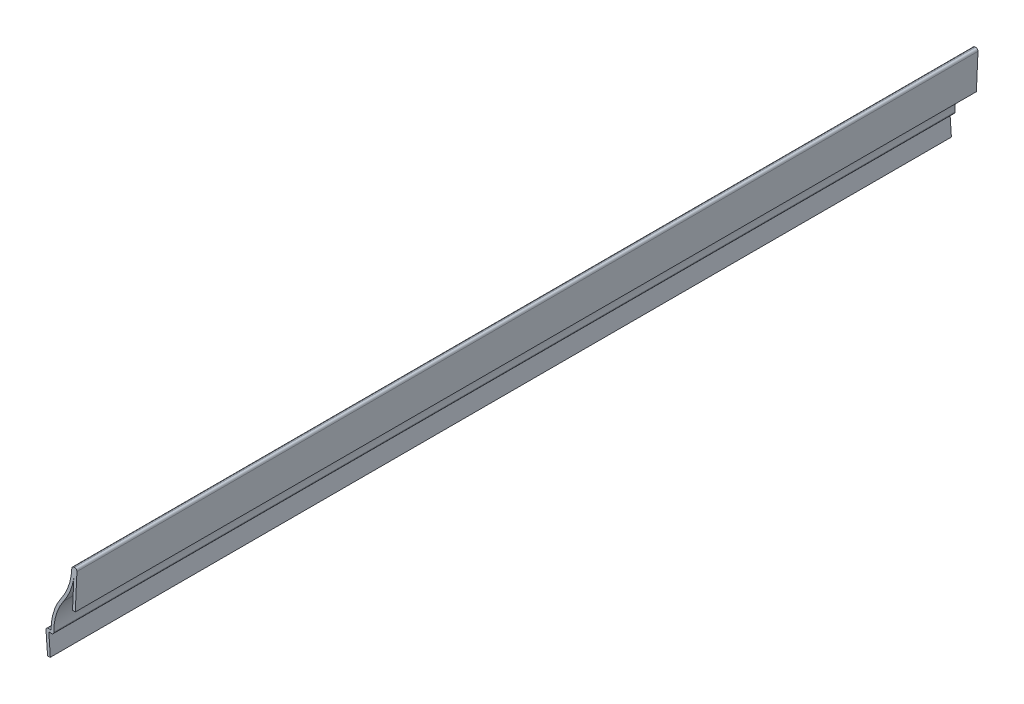
ISO-10303-21;
HEADER;
FILE_DESCRIPTION(('STEP AP214'),'2;1');
FILE_NAME('part.step','',(''),(''),'','','');
FILE_SCHEMA(('AUTOMOTIVE_DESIGN { 1 0 10303 214 1 1 1 1 }'));
ENDSEC;
DATA;
#1=APPLICATION_CONTEXT('core data for automotive mechanical design processes');
#2=APPLICATION_PROTOCOL_DEFINITION('international standard','automotive_design',2000,#1);
#3=PRODUCT_CONTEXT('',#1,'mechanical');
#4=PRODUCT('Part','Part','',(#3));
#5=PRODUCT_RELATED_PRODUCT_CATEGORY('part','',(#4));
#6=PRODUCT_DEFINITION_FORMATION('','',#4);
#7=PRODUCT_DEFINITION_CONTEXT('part definition',#1,'design');
#8=PRODUCT_DEFINITION('design','',#6,#7);
#9=PRODUCT_DEFINITION_SHAPE('','',#8);
#10=(LENGTH_UNIT() NAMED_UNIT(*) SI_UNIT(.MILLI.,.METRE.));
#11=(NAMED_UNIT(*) PLANE_ANGLE_UNIT() SI_UNIT($,.RADIAN.));
#12=(NAMED_UNIT(*) SI_UNIT($,.STERADIAN.) SOLID_ANGLE_UNIT());
#13=UNCERTAINTY_MEASURE_WITH_UNIT(LENGTH_MEASURE(1.E-05),#10,'distance_accuracy_value','');
#14=(GEOMETRIC_REPRESENTATION_CONTEXT(3) GLOBAL_UNCERTAINTY_ASSIGNED_CONTEXT((#13)) GLOBAL_UNIT_ASSIGNED_CONTEXT((#10,
#11,#12)) REPRESENTATION_CONTEXT('',''));
#15=CARTESIAN_POINT('',(0.,0.,0.));
#16=DIRECTION('',(0.,0.,1.));
#17=DIRECTION('',(1.,0.,0.));
#18=AXIS2_PLACEMENT_3D('',#15,#16,#17);
#19=CARTESIAN_POINT('',(12.2250599539329,41.3326677293667,-412.75));
#20=DIRECTION('',(-0.9989685402103,0.0454076609186498,0.));
#21=DIRECTION('',(-0.0454076609186498,-0.9989685402103,0.));
#22=AXIS2_PLACEMENT_3D('',#19,#20,#21);
#23=PLANE('',#22);
#24=DIRECTION('',(-0.0454076609186498,-0.9989685402103,0.));
#25=VECTOR('',#24,1.);
#26=CARTESIAN_POINT('',(12.2250599539329,41.3326677293667,0.));
#27=LINE('',#26,#25);
#28=CARTESIAN_POINT('',(12.0200511386789,36.8224737937788,0.));
#29=VERTEX_POINT('',#28);
#30=CARTESIAN_POINT('',(11.4313099539329,23.8701677293667,0.));
#31=VERTEX_POINT('',#30);
#32=EDGE_CURVE('E208',#29,#31,#27,.T.);
#33=ORIENTED_EDGE('',*,*,#32,.F.);
#34=DIRECTION('',(0.,0.,1.));
#35=VECTOR('',#34,1.);
#36=CARTESIAN_POINT('',(12.0200511386789,36.8224737937788,-412.75));
#37=LINE('',#36,#35);
#38=CARTESIAN_POINT('',(12.0200511386789,36.8224737937788,-412.75));
#39=VERTEX_POINT('',#38);
#40=EDGE_CURVE('E177',#39,#29,#37,.T.);
#41=ORIENTED_EDGE('',*,*,#40,.F.);
#42=DIRECTION('',(-0.0454076609186498,-0.9989685402103,0.));
#43=VECTOR('',#42,1.);
#44=CARTESIAN_POINT('',(12.2250599539329,41.3326677293667,-412.75));
#45=LINE('',#44,#43);
#46=CARTESIAN_POINT('',(11.4313099539329,23.8701677293667,-412.75));
#47=VERTEX_POINT('',#46);
#48=EDGE_CURVE('E159',#39,#47,#45,.T.);
#49=ORIENTED_EDGE('',*,*,#48,.T.);
#50=DIRECTION('',(0.,0.,1.));
#51=VECTOR('',#50,1.);
#52=CARTESIAN_POINT('',(11.4313099539329,23.8701677293667,-412.75));
#53=LINE('',#52,#51);
#54=EDGE_CURVE('E167',#47,#31,#53,.T.);
#55=ORIENTED_EDGE('',*,*,#54,.T.);
#56=EDGE_LOOP('',(#33,#41,#49,#55));
#57=FACE_BOUND('',#56,.T.);
#58=ADVANCED_FACE('F35',(#57),#23,.T.);
#59=CARTESIAN_POINT('',(-15.1473958333333,41.275,-412.75));
#60=DIRECTION('',(0.,0.,1.));
#61=DIRECTION('',(1.,0.,0.));
#62=AXIS2_PLACEMENT_3D('',#59,#60,#61);
#63=CYLINDRICAL_SURFACE('',#62,27.5298958333333);
#64=CARTESIAN_POINT('',(-15.1473958333333,41.275,0.));
#65=DIRECTION('',(0.,0.,1.));
#66=DIRECTION('',(1.,0.,0.));
#67=AXIS2_PLACEMENT_3D('',#64,#65,#66);
#68=CIRCLE('',#67,27.5298958333333);
#69=CARTESIAN_POINT('',(7.3896725440806,25.4643797229219,0.));
#70=VERTEX_POINT('',#69);
#71=EDGE_CURVE('E178',#70,#29,#68,.T.);
#72=ORIENTED_EDGE('',*,*,#71,.F.);
#73=DIRECTION('',(0.,0.,1.));
#74=VECTOR('',#73,1.);
#75=CARTESIAN_POINT('',(7.3896725440806,25.4643797229219,-412.75));
#76=LINE('',#75,#74);
#77=CARTESIAN_POINT('',(7.3896725440806,25.4643797229219,-412.75));
#78=VERTEX_POINT('',#77);
#79=EDGE_CURVE('E236',#78,#70,#76,.T.);
#80=ORIENTED_EDGE('',*,*,#79,.F.);
#81=CARTESIAN_POINT('',(-15.1473958333333,41.275,-412.75));
#82=DIRECTION('',(0.,0.,1.));
#83=DIRECTION('',(1.,0.,0.));
#84=AXIS2_PLACEMENT_3D('',#81,#82,#83);
#85=CIRCLE('',#84,27.5298958333333);
#86=EDGE_CURVE('E175',#78,#39,#85,.T.);
#87=ORIENTED_EDGE('',*,*,#86,.T.);
#88=ORIENTED_EDGE('',*,*,#40,.T.);
#89=EDGE_LOOP('',(#72,#80,#87,#88));
#90=FACE_BOUND('',#89,.T.);
#91=ADVANCED_FACE('F300',(#90),#63,.T.);
#92=CARTESIAN_POINT('',(27.8473958333333,11.1125,-412.75));
#93=DIRECTION('',(0.,0.,1.));
#94=DIRECTION('',(1.,0.,0.));
#95=AXIS2_PLACEMENT_3D('',#92,#93,#94);
#96=CYLINDRICAL_SURFACE('',#95,24.9898958333333);
#97=CARTESIAN_POINT('',(27.8473958333333,11.1125,0.));
#98=DIRECTION('',(0.,0.,1.));
#99=DIRECTION('',(1.,0.,0.));
#100=AXIS2_PLACEMENT_3D('',#97,#98,#99);
#101=CIRCLE('',#100,24.9898958333333);
#102=CARTESIAN_POINT('',(2.85869197899905,10.8684232882287,0.));
#103=VERTEX_POINT('',#102);
#104=EDGE_CURVE('E181',#103,#70,#101,.F.);
#105=ORIENTED_EDGE('',*,*,#104,.F.);
#106=DIRECTION('',(0.,0.,1.));
#107=VECTOR('',#106,1.);
#108=CARTESIAN_POINT('',(2.85869197899905,10.8684232882287,-412.75));
#109=LINE('',#108,#107);
#110=CARTESIAN_POINT('',(2.85869197899905,10.8684232882287,-412.75));
#111=VERTEX_POINT('',#110);
#112=EDGE_CURVE('E263',#103,#111,#109,.F.);
#113=ORIENTED_EDGE('',*,*,#112,.T.);
#114=CARTESIAN_POINT('',(27.8473958333333,11.1125,-412.75));
#115=DIRECTION('',(0.,0.,1.));
#116=DIRECTION('',(1.,0.,0.));
#117=AXIS2_PLACEMENT_3D('',#114,#115,#116);
#118=CIRCLE('',#117,24.9898958333333);
#119=EDGE_CURVE('E205',#111,#78,#118,.F.);
#120=ORIENTED_EDGE('',*,*,#119,.T.);
#121=ORIENTED_EDGE('',*,*,#79,.T.);
#122=EDGE_LOOP('',(#105,#113,#120,#121));
#123=FACE_BOUND('',#122,.T.);
#124=ADVANCED_FACE('F356',(#123),#96,.F.);
#125=CARTESIAN_POINT('',(-0.793750000000003,9.8425,-412.75));
#126=DIRECTION('',(0.,-1.,0.));
#127=DIRECTION('',(1.,0.,0.));
#128=AXIS2_PLACEMENT_3D('',#125,#126,#127);
#129=PLANE('',#128);
#130=DIRECTION('',(1.,0.,0.));
#131=VECTOR('',#130,1.);
#132=CARTESIAN_POINT('',(-0.793750000000003,9.8425,-412.75));
#133=LINE('',#132,#131);
#134=CARTESIAN_POINT('',(0.570199959748221,9.8425,-412.75));
#135=VERTEX_POINT('',#134);
#136=CARTESIAN_POINT('',(1.84274044061214,9.8425,-412.75));
#137=VERTEX_POINT('',#136);
#138=EDGE_CURVE('E202',#135,#137,#133,.T.);
#139=ORIENTED_EDGE('',*,*,#138,.T.);
#140=DIRECTION('',(0.,0.,1.));
#141=VECTOR('',#140,1.);
#142=CARTESIAN_POINT('',(1.84274044061214,9.8425,-412.75));
#143=LINE('',#142,#141);
#144=CARTESIAN_POINT('',(1.84274044061214,9.8425,0.));
#145=VERTEX_POINT('',#144);
#146=EDGE_CURVE('E235',#137,#145,#143,.T.);
#147=ORIENTED_EDGE('',*,*,#146,.T.);
#148=DIRECTION('',(1.,0.,0.));
#149=VECTOR('',#148,1.);
#150=CARTESIAN_POINT('',(-0.793750000000003,9.8425,0.));
#151=LINE('',#150,#149);
#152=CARTESIAN_POINT('',(0.570199959748221,9.8425,0.));
#153=VERTEX_POINT('',#152);
#154=EDGE_CURVE('E230',#153,#145,#151,.T.);
#155=ORIENTED_EDGE('',*,*,#154,.F.);
#156=DIRECTION('',(0.,0.,1.));
#157=VECTOR('',#156,1.);
#158=CARTESIAN_POINT('',(0.570199959748221,9.8425,-412.75));
#159=LINE('',#158,#157);
#160=EDGE_CURVE('E239',#135,#153,#159,.T.);
#161=ORIENTED_EDGE('',*,*,#160,.F.);
#162=EDGE_LOOP('',(#139,#147,#155,#161));
#163=FACE_BOUND('',#162,.T.);
#164=ADVANCED_FACE('F310',(#163),#129,.T.);
#165=CARTESIAN_POINT('',(1.26677254878503,0.0904837534846454,-412.75));
#166=DIRECTION('',(0.997458699830735,0.0712470499879098,0.));
#167=DIRECTION('',(-0.0712470499879098,0.997458699830735,0.));
#168=AXIS2_PLACEMENT_3D('',#165,#166,#167);
#169=PLANE('',#168);
#170=DIRECTION('',(-0.0712470499879098,0.997458699830735,0.));
#171=VECTOR('',#170,1.);
#172=CARTESIAN_POINT('',(1.26677254878503,0.0904837534846454,0.));
#173=LINE('',#172,#171);
#174=CARTESIAN_POINT('',(1.26677254878503,0.0904837534846454,0.));
#175=VERTEX_POINT('',#174);
#176=EDGE_CURVE('E227',#175,#153,#173,.T.);
#177=ORIENTED_EDGE('',*,*,#176,.F.);
#178=DIRECTION('',(0.,0.,1.));
#179=VECTOR('',#178,1.);
#180=CARTESIAN_POINT('',(1.26677254878503,0.0904837534846454,-412.75));
#181=LINE('',#180,#179);
#182=CARTESIAN_POINT('',(1.26677254878503,0.0904837534846454,-412.75));
#183=VERTEX_POINT('',#182);
#184=EDGE_CURVE('E241',#183,#175,#181,.T.);
#185=ORIENTED_EDGE('',*,*,#184,.F.);
#186=DIRECTION('',(-0.0712470499879098,0.997458699830735,0.));
#187=VECTOR('',#186,1.);
#188=CARTESIAN_POINT('',(1.26677254878503,0.0904837534846454,-412.75));
#189=LINE('',#188,#187);
#190=EDGE_CURVE('E199',#183,#135,#189,.T.);
#191=ORIENTED_EDGE('',*,*,#190,.T.);
#192=ORIENTED_EDGE('',*,*,#160,.T.);
#193=EDGE_LOOP('',(#177,#185,#191,#192));
#194=FACE_BOUND('',#193,.T.);
#195=ADVANCED_FACE('F315',(#194),#169,.T.);
#196=CARTESIAN_POINT('',(1.26677254878503,0.0904837534846454,-412.75));
#197=DIRECTION('',(-0.0712470499879098,0.997458699830735,0.));
#198=DIRECTION('',(-0.997458699830735,-0.0712470499879098,0.));
#199=AXIS2_PLACEMENT_3D('',#196,#197,#198);
#200=PLANE('',#199);
#201=DIRECTION('',(-0.997458699830735,-0.0712470499879098,0.));
#202=VECTOR('',#201,1.);
#203=CARTESIAN_POINT('',(1.26677254878503,0.0904837534846454,0.));
#204=LINE('',#203,#202);
#205=CARTESIAN_POINT('',(0.,0.,0.));
#206=VERTEX_POINT('',#205);
#207=EDGE_CURVE('E225',#175,#206,#204,.T.);
#208=ORIENTED_EDGE('',*,*,#207,.T.);
#209=DIRECTION('',(0.,0.,1.));
#210=VECTOR('',#209,1.);
#211=CARTESIAN_POINT('',(0.,0.,-412.75));
#212=LINE('',#211,#210);
#213=CARTESIAN_POINT('',(0.,0.,-412.75));
#214=VERTEX_POINT('',#213);
#215=EDGE_CURVE('E243',#214,#206,#212,.T.);
#216=ORIENTED_EDGE('',*,*,#215,.F.);
#217=DIRECTION('',(-0.997458699830735,-0.0712470499879098,0.));
#218=VECTOR('',#217,1.);
#219=CARTESIAN_POINT('',(1.26677254878503,0.0904837534846454,-412.75));
#220=LINE('',#219,#218);
#221=EDGE_CURVE('E197',#183,#214,#220,.T.);
#222=ORIENTED_EDGE('',*,*,#221,.F.);
#223=ORIENTED_EDGE('',*,*,#184,.T.);
#224=EDGE_LOOP('',(#208,#216,#222,#223));
#225=FACE_BOUND('',#224,.T.);
#226=ADVANCED_FACE('F322',(#225),#200,.F.);
#227=CARTESIAN_POINT('',(0.,0.,-412.75));
#228=DIRECTION('',(0.997458699830735,0.0712470499879098,0.));
#229=DIRECTION('',(-0.0712470499879098,0.997458699830735,0.));
#230=AXIS2_PLACEMENT_3D('',#227,#228,#229);
#231=PLANE('',#230);
#232=DIRECTION('',(-0.0712470499879098,0.997458699830735,0.));
#233=VECTOR('',#232,1.);
#234=CARTESIAN_POINT('',(0.,0.,0.));
#235=LINE('',#234,#233);
#236=CARTESIAN_POINT('',(-0.71600807122945,10.0241129972123,0.));
#237=VERTEX_POINT('',#236);
#238=EDGE_CURVE('E222',#206,#237,#235,.T.);
#239=ORIENTED_EDGE('',*,*,#238,.T.);
#240=DIRECTION('',(0.,0.,1.));
#241=VECTOR('',#240,1.);
#242=CARTESIAN_POINT('',(-0.71600807122945,10.0241129972123,-412.75));
#243=LINE('',#242,#241);
#244=CARTESIAN_POINT('',(-0.71600807122945,10.0241129972123,-412.75));
#245=VERTEX_POINT('',#244);
#246=EDGE_CURVE('E275',#237,#245,#243,.F.);
#247=ORIENTED_EDGE('',*,*,#246,.T.);
#248=DIRECTION('',(-0.0712470499879098,0.997458699830735,0.));
#249=VECTOR('',#248,1.);
#250=CARTESIAN_POINT('',(0.,0.,-412.75));
#251=LINE('',#250,#249);
#252=EDGE_CURVE('E194',#214,#245,#251,.T.);
#253=ORIENTED_EDGE('',*,*,#252,.F.);
#254=ORIENTED_EDGE('',*,*,#215,.T.);
#255=EDGE_LOOP('',(#239,#247,#253,#254));
#256=FACE_BOUND('',#255,.T.);
#257=ADVANCED_FACE('F324',(#256),#231,.F.);
#258=CARTESIAN_POINT('',(-0.793750000000001,11.1125,-412.75));
#259=DIRECTION('',(0.,-1.,0.));
#260=DIRECTION('',(1.,0.,0.));
#261=AXIS2_PLACEMENT_3D('',#258,#259,#260);
#262=PLANE('',#261);
#263=DIRECTION('',(1.,0.,0.));
#264=VECTOR('',#263,1.);
#265=CARTESIAN_POINT('',(-0.793750000000001,11.1125,-412.75));
#266=LINE('',#265,#264);
#267=CARTESIAN_POINT('',(0.297409967798578,11.1125,-412.75));
#268=VERTEX_POINT('',#267);
#269=CARTESIAN_POINT('',(1.58750000000001,11.1125,-412.75));
#270=VERTEX_POINT('',#269);
#271=EDGE_CURVE('E192',#268,#270,#266,.T.);
#272=ORIENTED_EDGE('',*,*,#271,.F.);
#273=DIRECTION('',(0.,0.,1.));
#274=VECTOR('',#273,1.);
#275=CARTESIAN_POINT('',(0.297409967798578,11.1125,-412.75));
#276=LINE('',#275,#274);
#277=CARTESIAN_POINT('',(0.297409967798578,11.1125,0.));
#278=VERTEX_POINT('',#277);
#279=EDGE_CURVE('E272',#268,#278,#276,.T.);
#280=ORIENTED_EDGE('',*,*,#279,.T.);
#281=DIRECTION('',(1.,0.,0.));
#282=VECTOR('',#281,1.);
#283=CARTESIAN_POINT('',(-0.793750000000001,11.1125,0.));
#284=LINE('',#283,#282);
#285=CARTESIAN_POINT('',(1.58750000000001,11.1125,0.));
#286=VERTEX_POINT('',#285);
#287=EDGE_CURVE('E220',#278,#286,#284,.T.);
#288=ORIENTED_EDGE('',*,*,#287,.T.);
#289=DIRECTION('',(0.,0.,1.));
#290=VECTOR('',#289,1.);
#291=CARTESIAN_POINT('',(1.58750000000001,11.1125,-412.75));
#292=LINE('',#291,#290);
#293=EDGE_CURVE('E246',#270,#286,#292,.T.);
#294=ORIENTED_EDGE('',*,*,#293,.F.);
#295=EDGE_LOOP('',(#272,#280,#288,#294));
#296=FACE_BOUND('',#295,.T.);
#297=ADVANCED_FACE('F332',(#296),#262,.F.);
#298=CARTESIAN_POINT('',(27.8473958333333,11.1125,-412.75));
#299=DIRECTION('',(0.,0.,1.));
#300=DIRECTION('',(1.,0.,0.));
#301=AXIS2_PLACEMENT_3D('',#298,#299,#300);
#302=CYLINDRICAL_SURFACE('',#301,26.2598958333333);
#303=CARTESIAN_POINT('',(27.8473958333333,11.1125,0.));
#304=DIRECTION('',(0.,0.,-1.));
#305=DIRECTION('',(-1.,0.,0.));
#306=AXIS2_PLACEMENT_3D('',#303,#304,#305);
#307=CIRCLE('',#306,26.2598958333333);
#308=CARTESIAN_POINT('',(6.35,26.19375,0.));
#309=VERTEX_POINT('',#308);
#310=EDGE_CURVE('E218',#286,#309,#307,.T.);
#311=ORIENTED_EDGE('',*,*,#310,.T.);
#312=DIRECTION('',(0.,0.,1.));
#313=VECTOR('',#312,1.);
#314=CARTESIAN_POINT('',(6.35,26.19375,-412.75));
#315=LINE('',#314,#313);
#316=CARTESIAN_POINT('',(6.35,26.19375,-412.75));
#317=VERTEX_POINT('',#316);
#318=EDGE_CURVE('E249',#317,#309,#315,.T.);
#319=ORIENTED_EDGE('',*,*,#318,.F.);
#320=CARTESIAN_POINT('',(27.8473958333333,11.1125,-412.75));
#321=DIRECTION('',(0.,0.,-1.));
#322=DIRECTION('',(-1.,0.,0.));
#323=AXIS2_PLACEMENT_3D('',#320,#321,#322);
#324=CIRCLE('',#323,26.2598958333333);
#325=EDGE_CURVE('E190',#270,#317,#324,.T.);
#326=ORIENTED_EDGE('',*,*,#325,.F.);
#327=ORIENTED_EDGE('',*,*,#293,.T.);
#328=EDGE_LOOP('',(#311,#319,#326,#327));
#329=FACE_BOUND('',#328,.T.);
#330=ADVANCED_FACE('F338',(#329),#302,.T.);
#331=CARTESIAN_POINT('',(-15.1473958333333,41.275,-412.75));
#332=DIRECTION('',(0.,0.,1.));
#333=DIRECTION('',(1.,0.,0.));
#334=AXIS2_PLACEMENT_3D('',#331,#332,#333);
#335=CYLINDRICAL_SURFACE('',#334,26.2598958333333);
#336=CARTESIAN_POINT('',(-15.1473958333333,41.275,0.));
#337=DIRECTION('',(0.,0.,1.));
#338=DIRECTION('',(1.,0.,0.));
#339=AXIS2_PLACEMENT_3D('',#336,#337,#338);
#340=CIRCLE('',#339,26.2598958333333);
#341=CARTESIAN_POINT('',(11.0942760256311,40.2968449898147,0.));
#342=VERTEX_POINT('',#341);
#343=EDGE_CURVE('E215',#309,#342,#340,.T.);
#344=ORIENTED_EDGE('',*,*,#343,.T.);
#345=DIRECTION('',(0.,0.,1.));
#346=VECTOR('',#345,1.);
#347=CARTESIAN_POINT('',(11.0942760256311,40.2968449898147,-412.75));
#348=LINE('',#347,#346);
#349=CARTESIAN_POINT('',(11.0942760256311,40.2968449898147,-412.75));
#350=VERTEX_POINT('',#349);
#351=EDGE_CURVE('E11',#342,#350,#348,.F.);
#352=ORIENTED_EDGE('',*,*,#351,.T.);
#353=CARTESIAN_POINT('',(-15.1473958333333,41.275,-412.75));
#354=DIRECTION('',(0.,0.,1.));
#355=DIRECTION('',(1.,0.,0.));
#356=AXIS2_PLACEMENT_3D('',#353,#354,#355);
#357=CIRCLE('',#356,26.2598958333333);
#358=EDGE_CURVE('E187',#317,#350,#357,.T.);
#359=ORIENTED_EDGE('',*,*,#358,.F.);
#360=ORIENTED_EDGE('',*,*,#318,.T.);
#361=EDGE_LOOP('',(#344,#352,#359,#360));
#362=FACE_BOUND('',#361,.T.);
#363=ADVANCED_FACE('F342',(#362),#335,.F.);
#364=CARTESIAN_POINT('',(11.1125,41.275,-412.75));
#365=DIRECTION('',(0.,-1.,0.));
#366=DIRECTION('',(1.,0.,0.));
#367=AXIS2_PLACEMENT_3D('',#364,#365,#366);
#368=PLANE('',#367);
#369=DIRECTION('',(1.,0.,0.));
#370=VECTOR('',#369,1.);
#371=CARTESIAN_POINT('',(11.1125,41.275,0.));
#372=LINE('',#371,#370);
#373=CARTESIAN_POINT('',(12.1095709368495,41.275,0.));
#374=VERTEX_POINT('',#373);
#375=CARTESIAN_POINT('',(12.4305191366239,41.275,0.));
#376=VERTEX_POINT('',#375);
#377=EDGE_CURVE('E213',#374,#376,#372,.T.);
#378=ORIENTED_EDGE('',*,*,#377,.T.);
#379=DIRECTION('',(0.,0.,1.));
#380=VECTOR('',#379,1.);
#381=CARTESIAN_POINT('',(12.4305191366239,41.275,-412.75));
#382=LINE('',#381,#380);
#383=CARTESIAN_POINT('',(12.4305191366239,41.275,-412.75));
#384=VERTEX_POINT('',#383);
#385=EDGE_CURVE('E43',#376,#384,#382,.F.);
#386=ORIENTED_EDGE('',*,*,#385,.T.);
#387=DIRECTION('',(1.,0.,0.));
#388=VECTOR('',#387,1.);
#389=CARTESIAN_POINT('',(11.1125,41.275,-412.75));
#390=LINE('',#389,#388);
#391=CARTESIAN_POINT('',(12.1095709368495,41.275,-412.75));
#392=VERTEX_POINT('',#391);
#393=EDGE_CURVE('E185',#392,#384,#390,.T.);
#394=ORIENTED_EDGE('',*,*,#393,.F.);
#395=DIRECTION('',(0.,0.,1.));
#396=VECTOR('',#395,1.);
#397=CARTESIAN_POINT('',(12.1095709368495,41.275,-412.75));
#398=LINE('',#397,#396);
#399=EDGE_CURVE('E280',#392,#374,#398,.T.);
#400=ORIENTED_EDGE('',*,*,#399,.T.);
#401=EDGE_LOOP('',(#378,#386,#394,#400));
#402=FACE_BOUND('',#401,.T.);
#403=ADVANCED_FACE('F284',(#402),#368,.F.);
#404=CARTESIAN_POINT('',(13.49375,41.275,-412.75));
#405=DIRECTION('',(-0.9989685402103,0.0454076609186498,0.));
#406=DIRECTION('',(-0.0454076609186498,-0.9989685402103,0.));
#407=AXIS2_PLACEMENT_3D('',#404,#405,#406);
#408=PLANE('',#407);
#409=DIRECTION('',(-0.0454076609186499,-0.9989685402103,0.));
#410=VECTOR('',#409,1.);
#411=CARTESIAN_POINT('',(13.49375,41.275,-412.75));
#412=LINE('',#411,#410);
#413=CARTESIAN_POINT('',(13.4454711734776,40.2128658165066,-412.75));
#414=VERTEX_POINT('',#413);
#415=CARTESIAN_POINT('',(12.7,23.8125,-412.75));
#416=VERTEX_POINT('',#415);
#417=EDGE_CURVE('E161',#414,#416,#412,.T.);
#418=ORIENTED_EDGE('',*,*,#417,.F.);
#419=DIRECTION('',(0.,0.,1.));
#420=VECTOR('',#419,1.);
#421=CARTESIAN_POINT('',(13.4454711734776,40.2128658165066,-412.75));
#422=LINE('',#421,#420);
#423=CARTESIAN_POINT('',(13.4454711734776,40.2128658165066,0.));
#424=VERTEX_POINT('',#423);
#425=EDGE_CURVE('E277',#414,#424,#422,.T.);
#426=ORIENTED_EDGE('',*,*,#425,.T.);
#427=DIRECTION('',(-0.0454076609186499,-0.9989685402103,0.));
#428=VECTOR('',#427,1.);
#429=CARTESIAN_POINT('',(13.49375,41.275,0.));
#430=LINE('',#429,#428);
#431=CARTESIAN_POINT('',(12.7,23.8125,0.));
#432=VERTEX_POINT('',#431);
#433=EDGE_CURVE('E211',#424,#432,#430,.T.);
#434=ORIENTED_EDGE('',*,*,#433,.T.);
#435=DIRECTION('',(0.,0.,1.));
#436=VECTOR('',#435,1.);
#437=CARTESIAN_POINT('',(12.7,23.8125,-412.75));
#438=LINE('',#437,#436);
#439=EDGE_CURVE('E174',#416,#432,#438,.T.);
#440=ORIENTED_EDGE('',*,*,#439,.F.);
#441=EDGE_LOOP('',(#418,#426,#434,#440));
#442=FACE_BOUND('',#441,.T.);
#443=ADVANCED_FACE('F295',(#442),#408,.F.);
#444=CARTESIAN_POINT('',(12.7,23.8125,-412.75));
#445=DIRECTION('',(0.0454076609186504,0.9989685402103,0.));
#446=DIRECTION('',(-0.9989685402103,0.0454076609186504,0.));
#447=AXIS2_PLACEMENT_3D('',#444,#445,#446);
#448=PLANE('',#447);
#449=DIRECTION('',(-0.9989685402103,0.0454076609186504,0.));
#450=VECTOR('',#449,1.);
#451=CARTESIAN_POINT('',(12.7,23.8125,0.));
#452=LINE('',#451,#450);
#453=EDGE_CURVE('E170',#432,#31,#452,.T.);
#454=ORIENTED_EDGE('',*,*,#453,.T.);
#455=ORIENTED_EDGE('',*,*,#54,.F.);
#456=DIRECTION('',(-0.9989685402103,0.0454076609186504,0.));
#457=VECTOR('',#456,1.);
#458=CARTESIAN_POINT('',(12.7,23.8125,-412.75));
#459=LINE('',#458,#457);
#460=EDGE_CURVE('E153',#416,#47,#459,.T.);
#461=ORIENTED_EDGE('',*,*,#460,.F.);
#462=ORIENTED_EDGE('',*,*,#439,.T.);
#463=EDGE_LOOP('',(#454,#455,#461,#462));
#464=FACE_BOUND('',#463,.T.);
#465=ADVANCED_FACE('F168',(#464),#448,.F.);
#466=CARTESIAN_POINT('',(-15.1473958333333,41.275,-412.75));
#467=DIRECTION('',(0.,0.,1.));
#468=DIRECTION('',(1.,0.,0.));
#469=AXIS2_PLACEMENT_3D('',#466,#467,#468);
#470=PLANE('',#469);
#471=ORIENTED_EDGE('',*,*,#119,.F.);
#472=CARTESIAN_POINT('',(1.84274044061214,10.8585,-412.75));
#473=DIRECTION('',(0.,0.,1.));
#474=DIRECTION('',(1.,0.,0.));
#475=AXIS2_PLACEMENT_3D('',#472,#473,#474);
#476=CIRCLE('',#475,1.016);
#477=EDGE_CURVE('E270',#111,#137,#476,.F.);
#478=ORIENTED_EDGE('',*,*,#477,.T.);
#479=ORIENTED_EDGE('',*,*,#138,.F.);
#480=ORIENTED_EDGE('',*,*,#190,.F.);
#481=ORIENTED_EDGE('',*,*,#221,.T.);
#482=ORIENTED_EDGE('',*,*,#252,.T.);
#483=CARTESIAN_POINT('',(0.297409967798577,10.0965,-412.75));
#484=DIRECTION('',(0.,0.,1.));
#485=DIRECTION('',(1.,0.,0.));
#486=AXIS2_PLACEMENT_3D('',#483,#484,#485);
#487=CIRCLE('',#486,1.016);
#488=EDGE_CURVE('E268',#245,#268,#487,.F.);
#489=ORIENTED_EDGE('',*,*,#488,.T.);
#490=ORIENTED_EDGE('',*,*,#271,.T.);
#491=ORIENTED_EDGE('',*,*,#325,.T.);
#492=ORIENTED_EDGE('',*,*,#358,.T.);
#493=CARTESIAN_POINT('',(12.1095709368495,40.259,-412.75));
#494=DIRECTION('',(0.,0.,1.));
#495=DIRECTION('',(1.,0.,0.));
#496=AXIS2_PLACEMENT_3D('',#493,#494,#495);
#497=CIRCLE('',#496,1.016);
#498=EDGE_CURVE('E265',#350,#392,#497,.F.);
#499=ORIENTED_EDGE('',*,*,#498,.T.);
#500=ORIENTED_EDGE('',*,*,#393,.T.);
#501=CARTESIAN_POINT('',(12.4305191366239,40.259,-412.75));
#502=DIRECTION('',(0.,0.,1.));
#503=DIRECTION('',(1.,0.,0.));
#504=AXIS2_PLACEMENT_3D('',#501,#502,#503);
#505=CIRCLE('',#504,1.016);
#506=EDGE_CURVE('E50',#384,#414,#505,.F.);
#507=ORIENTED_EDGE('',*,*,#506,.T.);
#508=ORIENTED_EDGE('',*,*,#417,.T.);
#509=ORIENTED_EDGE('',*,*,#460,.T.);
#510=ORIENTED_EDGE('',*,*,#48,.F.);
#511=ORIENTED_EDGE('',*,*,#86,.F.);
#512=EDGE_LOOP('',(#471,#478,#479,#480,#481,#482,#489,#490,#491,#492,#499,#500,#507,#508,#509,
#510,#511));
#513=FACE_BOUND('',#512,.T.);
#514=ADVANCED_FACE('F156',(#513),#470,.F.);
#515=CARTESIAN_POINT('',(-15.1473958333333,41.275,0.));
#516=DIRECTION('',(0.,0.,1.));
#517=DIRECTION('',(1.,0.,0.));
#518=AXIS2_PLACEMENT_3D('',#515,#516,#517);
#519=PLANE('',#518);
#520=ORIENTED_EDGE('',*,*,#154,.T.);
#521=CARTESIAN_POINT('',(1.84274044061214,10.8585,0.));
#522=DIRECTION('',(0.,0.,1.));
#523=DIRECTION('',(1.,0.,0.));
#524=AXIS2_PLACEMENT_3D('',#521,#522,#523);
#525=CIRCLE('',#524,1.016);
#526=EDGE_CURVE('E261',#145,#103,#525,.T.);
#527=ORIENTED_EDGE('',*,*,#526,.T.);
#528=ORIENTED_EDGE('',*,*,#104,.T.);
#529=ORIENTED_EDGE('',*,*,#71,.T.);
#530=ORIENTED_EDGE('',*,*,#32,.T.);
#531=ORIENTED_EDGE('',*,*,#453,.F.);
#532=ORIENTED_EDGE('',*,*,#433,.F.);
#533=CARTESIAN_POINT('',(12.4305191366239,40.259,0.));
#534=DIRECTION('',(0.,0.,1.));
#535=DIRECTION('',(1.,0.,0.));
#536=AXIS2_PLACEMENT_3D('',#533,#534,#535);
#537=CIRCLE('',#536,1.016);
#538=EDGE_CURVE('E257',#424,#376,#537,.T.);
#539=ORIENTED_EDGE('',*,*,#538,.T.);
#540=ORIENTED_EDGE('',*,*,#377,.F.);
#541=CARTESIAN_POINT('',(12.1095709368495,40.259,0.));
#542=DIRECTION('',(0.,0.,1.));
#543=DIRECTION('',(1.,0.,0.));
#544=AXIS2_PLACEMENT_3D('',#541,#542,#543);
#545=CIRCLE('',#544,1.016);
#546=EDGE_CURVE('E255',#374,#342,#545,.T.);
#547=ORIENTED_EDGE('',*,*,#546,.T.);
#548=ORIENTED_EDGE('',*,*,#343,.F.);
#549=ORIENTED_EDGE('',*,*,#310,.F.);
#550=ORIENTED_EDGE('',*,*,#287,.F.);
#551=CARTESIAN_POINT('',(0.297409967798577,10.0965,0.));
#552=DIRECTION('',(0.,0.,1.));
#553=DIRECTION('',(1.,0.,0.));
#554=AXIS2_PLACEMENT_3D('',#551,#552,#553);
#555=CIRCLE('',#554,1.016);
#556=EDGE_CURVE('E259',#278,#237,#555,.T.);
#557=ORIENTED_EDGE('',*,*,#556,.T.);
#558=ORIENTED_EDGE('',*,*,#238,.F.);
#559=ORIENTED_EDGE('',*,*,#207,.F.);
#560=ORIENTED_EDGE('',*,*,#176,.T.);
#561=EDGE_LOOP('',(#520,#527,#528,#529,#530,#531,#532,#539,#540,#547,#548,#549,#550,#557,#558,
#559,#560));
#562=FACE_BOUND('',#561,.T.);
#563=ADVANCED_FACE('F288',(#562),#519,.T.);
#564=CARTESIAN_POINT('',(1.84274044061214,10.8585,-412.75));
#565=DIRECTION('',(0.,0.,1.));
#566=DIRECTION('',(1.,0.,0.));
#567=AXIS2_PLACEMENT_3D('',#564,#565,#566);
#568=CYLINDRICAL_SURFACE('',#567,1.016);
#569=ORIENTED_EDGE('',*,*,#477,.F.);
#570=ORIENTED_EDGE('',*,*,#112,.F.);
#571=ORIENTED_EDGE('',*,*,#526,.F.);
#572=ORIENTED_EDGE('',*,*,#146,.F.);
#573=EDGE_LOOP('',(#569,#570,#571,#572));
#574=FACE_BOUND('',#573,.T.);
#575=ADVANCED_FACE('F307',(#574),#568,.T.);
#576=CARTESIAN_POINT('',(0.297409967798577,10.0965,-412.75));
#577=DIRECTION('',(0.,0.,1.));
#578=DIRECTION('',(1.,0.,0.));
#579=AXIS2_PLACEMENT_3D('',#576,#577,#578);
#580=CYLINDRICAL_SURFACE('',#579,1.016);
#581=ORIENTED_EDGE('',*,*,#488,.F.);
#582=ORIENTED_EDGE('',*,*,#246,.F.);
#583=ORIENTED_EDGE('',*,*,#556,.F.);
#584=ORIENTED_EDGE('',*,*,#279,.F.);
#585=EDGE_LOOP('',(#581,#582,#583,#584));
#586=FACE_BOUND('',#585,.T.);
#587=ADVANCED_FACE('F327',(#586),#580,.T.);
#588=CARTESIAN_POINT('',(12.4305191366239,40.259,-412.75));
#589=DIRECTION('',(0.,0.,1.));
#590=DIRECTION('',(1.,0.,0.));
#591=AXIS2_PLACEMENT_3D('',#588,#589,#590);
#592=CYLINDRICAL_SURFACE('',#591,1.016);
#593=ORIENTED_EDGE('',*,*,#506,.F.);
#594=ORIENTED_EDGE('',*,*,#385,.F.);
#595=ORIENTED_EDGE('',*,*,#538,.F.);
#596=ORIENTED_EDGE('',*,*,#425,.F.);
#597=EDGE_LOOP('',(#593,#594,#595,#596));
#598=FACE_BOUND('',#597,.T.);
#599=ADVANCED_FACE('F293',(#598),#592,.T.);
#600=CARTESIAN_POINT('',(12.1095709368495,40.259,-412.75));
#601=DIRECTION('',(0.,0.,1.));
#602=DIRECTION('',(1.,0.,0.));
#603=AXIS2_PLACEMENT_3D('',#600,#601,#602);
#604=CYLINDRICAL_SURFACE('',#603,1.016);
#605=ORIENTED_EDGE('',*,*,#498,.F.);
#606=ORIENTED_EDGE('',*,*,#351,.F.);
#607=ORIENTED_EDGE('',*,*,#546,.F.);
#608=ORIENTED_EDGE('',*,*,#399,.F.);
#609=EDGE_LOOP('',(#605,#606,#607,#608));
#610=FACE_BOUND('',#609,.T.);
#611=ADVANCED_FACE('F37',(#610),#604,.T.);
#612=CLOSED_SHELL('',(#58,#91,#124,#164,#195,#226,#257,#297,#330,#363,#403,#443,#465,#514,#563,
#575,#587,#599,#611));
#613=MANIFOLD_SOLID_BREP('B2',#612);
#614=ADVANCED_BREP_SHAPE_REPRESENTATION('',(#18,#613),#14);
#615=SHAPE_DEFINITION_REPRESENTATION(#9,#614);
ENDSEC;
END-ISO-10303-21;
